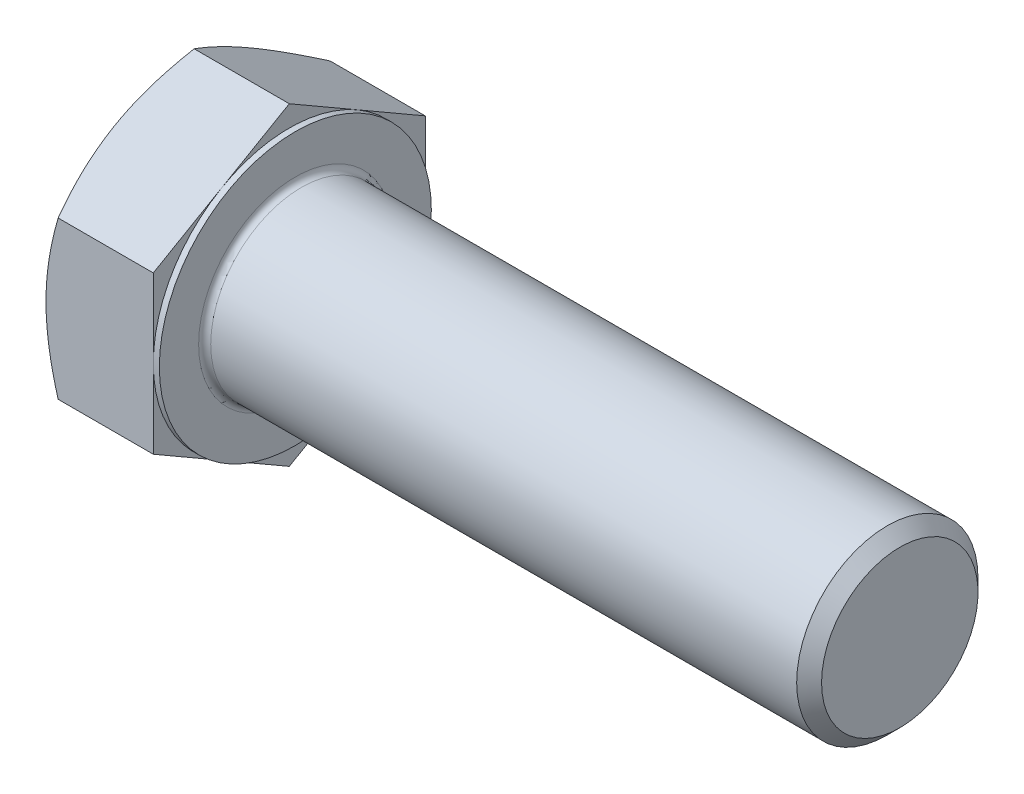
ISO-10303-21;
HEADER;
FILE_DESCRIPTION(('STEP AP214'),'2;1');
FILE_NAME('part.step','',(''),(''),'','','');
FILE_SCHEMA(('AUTOMOTIVE_DESIGN { 1 0 10303 214 1 1 1 1 }'));
ENDSEC;
DATA;
#1=APPLICATION_CONTEXT('core data for automotive mechanical design processes');
#2=APPLICATION_PROTOCOL_DEFINITION('international standard','automotive_design',2000,#1);
#3=PRODUCT_CONTEXT('',#1,'mechanical');
#4=PRODUCT('Part','Part','',(#3));
#5=PRODUCT_RELATED_PRODUCT_CATEGORY('part','',(#4));
#6=PRODUCT_DEFINITION_FORMATION('','',#4);
#7=PRODUCT_DEFINITION_CONTEXT('part definition',#1,'design');
#8=PRODUCT_DEFINITION('design','',#6,#7);
#9=PRODUCT_DEFINITION_SHAPE('','',#8);
#10=(LENGTH_UNIT() NAMED_UNIT(*) SI_UNIT(.MILLI.,.METRE.));
#11=(NAMED_UNIT(*) PLANE_ANGLE_UNIT() SI_UNIT($,.RADIAN.));
#12=(NAMED_UNIT(*) SI_UNIT($,.STERADIAN.) SOLID_ANGLE_UNIT());
#13=UNCERTAINTY_MEASURE_WITH_UNIT(LENGTH_MEASURE(1.E-05),#10,'distance_accuracy_value','');
#14=(GEOMETRIC_REPRESENTATION_CONTEXT(3) GLOBAL_UNCERTAINTY_ASSIGNED_CONTEXT((#13)) GLOBAL_UNIT_ASSIGNED_CONTEXT((#10,
#11,#12)) REPRESENTATION_CONTEXT('',''));
#15=CARTESIAN_POINT('',(0.,0.,0.));
#16=DIRECTION('',(0.,0.,1.));
#17=DIRECTION('',(1.,0.,0.));
#18=AXIS2_PLACEMENT_3D('',#15,#16,#17);
#19=CARTESIAN_POINT('',(15.,-31.1769145362398,-18.));
#20=DIRECTION('',(-1.,0.,0.));
#21=DIRECTION('',(0.,0.,1.));
#22=AXIS2_PLACEMENT_3D('',#19,#20,#21);
#23=PLANE('',#22);
#24=CARTESIAN_POINT('',(15.,0.,0.));
#25=DIRECTION('',(-1.,0.,0.));
#26=DIRECTION('',(0.,0.,1.));
#27=AXIS2_PLACEMENT_3D('',#24,#25,#26);
#28=CIRCLE('',#27,12.8);
#29=CARTESIAN_POINT('',(15.,0.,12.8));
#30=VERTEX_POINT('',#29);
#31=EDGE_CURVE('E11',#30,#30,#28,.T.);
#32=ORIENTED_EDGE('',*,*,#31,.T.);
#33=EDGE_LOOP('',(#32));
#34=FACE_BOUND('',#33,.T.);
#35=CARTESIAN_POINT('',(15.,0.,0.));
#36=DIRECTION('',(-1.,0.,0.));
#37=DIRECTION('',(0.,0.,1.));
#38=AXIS2_PLACEMENT_3D('',#35,#36,#37);
#39=CIRCLE('',#38,18.);
#40=CARTESIAN_POINT('',(15.,0.,18.));
#41=VERTEX_POINT('',#40);
#42=EDGE_CURVE('E163',#41,#41,#39,.T.);
#43=ORIENTED_EDGE('',*,*,#42,.F.);
#44=EDGE_LOOP('',(#43));
#45=FACE_BOUND('',#44,.T.);
#46=ADVANCED_FACE('F34',(#34,#45),#23,.F.);
#47=CARTESIAN_POINT('',(0.,0.,0.));
#48=DIRECTION('',(-1.,0.,0.));
#49=DIRECTION('',(0.,0.,1.));
#50=AXIS2_PLACEMENT_3D('',#47,#48,#49);
#51=CYLINDRICAL_SURFACE('',#50,12.);
#52=CARTESIAN_POINT('',(15.8,0.,0.));
#53=DIRECTION('',(-1.,0.,0.));
#54=DIRECTION('',(0.,0.,1.));
#55=AXIS2_PLACEMENT_3D('',#52,#53,#54);
#56=CIRCLE('',#55,12.);
#57=CARTESIAN_POINT('',(15.8,0.,12.));
#58=VERTEX_POINT('',#57);
#59=EDGE_CURVE('E42',#58,#58,#56,.F.);
#60=ORIENTED_EDGE('',*,*,#59,.T.);
#61=EDGE_LOOP('',(#60));
#62=FACE_BOUND('',#61,.T.);
#63=CARTESIAN_POINT('',(93.352,0.,0.));
#64=DIRECTION('',(-1.,0.,0.));
#65=DIRECTION('',(0.,0.,1.));
#66=AXIS2_PLACEMENT_3D('',#63,#64,#65);
#67=CIRCLE('',#66,12.);
#68=CARTESIAN_POINT('',(93.352,0.,12.));
#69=VERTEX_POINT('',#68);
#70=EDGE_CURVE('E504',#69,#69,#67,.T.);
#71=ORIENTED_EDGE('',*,*,#70,.T.);
#72=EDGE_LOOP('',(#71));
#73=FACE_BOUND('',#72,.T.);
#74=ADVANCED_FACE('F230',(#62,#73),#51,.T.);
#75=CARTESIAN_POINT('',(95.,0.,0.));
#76=DIRECTION('',(-1.,0.,0.));
#77=DIRECTION('',(0.,0.,1.));
#78=AXIS2_PLACEMENT_3D('',#75,#76,#77);
#79=PLANE('',#78);
#80=CARTESIAN_POINT('',(95.,0.,0.));
#81=DIRECTION('',(-1.,0.,0.));
#82=DIRECTION('',(0.,0.,1.));
#83=AXIS2_PLACEMENT_3D('',#80,#81,#82);
#84=CIRCLE('',#83,10.352);
#85=CARTESIAN_POINT('',(95.,0.,10.352));
#86=VERTEX_POINT('',#85);
#87=EDGE_CURVE('E502',#86,#86,#84,.T.);
#88=ORIENTED_EDGE('',*,*,#87,.F.);
#89=EDGE_LOOP('',(#88));
#90=FACE_BOUND('',#89,.T.);
#91=ADVANCED_FACE('F283',(#90),#79,.F.);
#92=CARTESIAN_POINT('',(95.,0.,0.));
#93=DIRECTION('',(-1.,0.,0.));
#94=DIRECTION('',(0.,0.,1.));
#95=AXIS2_PLACEMENT_3D('',#92,#93,#94);
#96=CONICAL_SURFACE('',#95,10.352,0.785398163397445);
#97=ORIENTED_EDGE('',*,*,#70,.F.);
#98=EDGE_LOOP('',(#97));
#99=FACE_BOUND('',#98,.T.);
#100=ORIENTED_EDGE('',*,*,#87,.T.);
#101=EDGE_LOOP('',(#100));
#102=FACE_BOUND('',#101,.T.);
#103=ADVANCED_FACE('F464',(#99,#102),#96,.T.);
#104=CARTESIAN_POINT('',(14.2,20.7846096908265,0.));
#105=DIRECTION('',(1.,0.,0.));
#106=DIRECTION('',(0.,0.,-1.));
#107=AXIS2_PLACEMENT_3D('',#104,#105,#106);
#108=PLANE('',#107);
#109=DIRECTION('',(0.,1.,0.));
#110=VECTOR('',#109,1.);
#111=CARTESIAN_POINT('',(14.2,-10.3923048454133,-18.));
#112=LINE('',#111,#110);
#113=CARTESIAN_POINT('',(14.2,-10.3923048454133,-18.));
#114=VERTEX_POINT('',#113);
#115=CARTESIAN_POINT('',(14.2,0.,-18.));
#116=VERTEX_POINT('',#115);
#117=EDGE_CURVE('E188',#114,#116,#112,.T.);
#118=ORIENTED_EDGE('',*,*,#117,.T.);
#119=CARTESIAN_POINT('',(14.2,0.,0.));
#120=DIRECTION('',(-1.,0.,0.));
#121=DIRECTION('',(0.,0.,1.));
#122=AXIS2_PLACEMENT_3D('',#119,#120,#121);
#123=CIRCLE('',#122,18.);
#124=CARTESIAN_POINT('',(14.2,-15.5884572681199,-9.));
#125=VERTEX_POINT('',#124);
#126=EDGE_CURVE('E49',#116,#125,#123,.T.);
#127=ORIENTED_EDGE('',*,*,#126,.T.);
#128=DIRECTION('',(0.,0.5,-0.866025403784439));
#129=VECTOR('',#128,1.);
#130=CARTESIAN_POINT('',(14.2,-20.7846096908265,0.));
#131=LINE('',#130,#129);
#132=EDGE_CURVE('E166',#125,#114,#131,.T.);
#133=ORIENTED_EDGE('',*,*,#132,.T.);
#134=EDGE_LOOP('',(#118,#127,#133));
#135=FACE_BOUND('',#134,.T.);
#136=ADVANCED_FACE('F187',(#135),#108,.T.);
#137=CARTESIAN_POINT('',(14.2,10.3923048454133,-18.));
#138=VERTEX_POINT('',#137);
#139=EDGE_CURVE('E195',#116,#138,#112,.T.);
#140=ORIENTED_EDGE('',*,*,#139,.T.);
#141=DIRECTION('',(0.,0.5,0.866025403784439));
#142=VECTOR('',#141,1.);
#143=CARTESIAN_POINT('',(14.2,10.3923048454133,-18.));
#144=LINE('',#143,#142);
#145=CARTESIAN_POINT('',(14.2,15.5884572681199,-9.));
#146=VERTEX_POINT('',#145);
#147=EDGE_CURVE('E199',#138,#146,#144,.T.);
#148=ORIENTED_EDGE('',*,*,#147,.T.);
#149=EDGE_CURVE('E329',#146,#116,#123,.T.);
#150=ORIENTED_EDGE('',*,*,#149,.T.);
#151=EDGE_LOOP('',(#140,#148,#150));
#152=FACE_BOUND('',#151,.T.);
#153=ADVANCED_FACE('F333',(#152),#108,.T.);
#154=CARTESIAN_POINT('',(14.2,20.7846096908265,0.));
#155=VERTEX_POINT('',#154);
#156=EDGE_CURVE('E201',#146,#155,#144,.T.);
#157=ORIENTED_EDGE('',*,*,#156,.T.);
#158=DIRECTION('',(0.,-0.5,0.866025403784439));
#159=VECTOR('',#158,1.);
#160=CARTESIAN_POINT('',(14.2,20.7846096908265,0.));
#161=LINE('',#160,#159);
#162=CARTESIAN_POINT('',(14.2,15.5884572681199,9.));
#163=VERTEX_POINT('',#162);
#164=EDGE_CURVE('E134',#155,#163,#161,.T.);
#165=ORIENTED_EDGE('',*,*,#164,.T.);
#166=EDGE_CURVE('E326',#163,#146,#123,.T.);
#167=ORIENTED_EDGE('',*,*,#166,.T.);
#168=EDGE_LOOP('',(#157,#165,#167));
#169=FACE_BOUND('',#168,.T.);
#170=ADVANCED_FACE('F339',(#169),#108,.T.);
#171=CARTESIAN_POINT('',(14.2,10.3923048454133,18.));
#172=VERTEX_POINT('',#171);
#173=EDGE_CURVE('E124',#163,#172,#161,.T.);
#174=ORIENTED_EDGE('',*,*,#173,.T.);
#175=DIRECTION('',(0.,-1.,0.));
#176=VECTOR('',#175,1.);
#177=CARTESIAN_POINT('',(14.2,10.3923048454133,18.));
#178=LINE('',#177,#176);
#179=CARTESIAN_POINT('',(14.2,0.,18.));
#180=VERTEX_POINT('',#179);
#181=EDGE_CURVE('E127',#172,#180,#178,.T.);
#182=ORIENTED_EDGE('',*,*,#181,.T.);
#183=EDGE_CURVE('E130',#180,#163,#123,.T.);
#184=ORIENTED_EDGE('',*,*,#183,.T.);
#185=EDGE_LOOP('',(#174,#182,#184));
#186=FACE_BOUND('',#185,.T.);
#187=ADVANCED_FACE('F126',(#186),#108,.T.);
#188=CARTESIAN_POINT('',(14.2,-10.3923048454132,18.));
#189=VERTEX_POINT('',#188);
#190=EDGE_CURVE('E142',#180,#189,#178,.T.);
#191=ORIENTED_EDGE('',*,*,#190,.T.);
#192=DIRECTION('',(0.,-0.5,-0.866025403784439));
#193=VECTOR('',#192,1.);
#194=CARTESIAN_POINT('',(14.2,-10.3923048454133,18.));
#195=LINE('',#194,#193);
#196=CARTESIAN_POINT('',(14.2,-15.5884572681199,9.));
#197=VERTEX_POINT('',#196);
#198=EDGE_CURVE('E321',#189,#197,#195,.T.);
#199=ORIENTED_EDGE('',*,*,#198,.T.);
#200=EDGE_CURVE('E327',#197,#180,#123,.T.);
#201=ORIENTED_EDGE('',*,*,#200,.T.);
#202=EDGE_LOOP('',(#191,#199,#201));
#203=FACE_BOUND('',#202,.T.);
#204=ADVANCED_FACE('F435',(#203),#108,.T.);
#205=CARTESIAN_POINT('',(14.2,-20.7846096908265,0.));
#206=VERTEX_POINT('',#205);
#207=EDGE_CURVE('E179',#197,#206,#195,.T.);
#208=ORIENTED_EDGE('',*,*,#207,.T.);
#209=EDGE_CURVE('E167',#206,#125,#131,.T.);
#210=ORIENTED_EDGE('',*,*,#209,.T.);
#211=EDGE_CURVE('E177',#125,#197,#123,.T.);
#212=ORIENTED_EDGE('',*,*,#211,.T.);
#213=EDGE_LOOP('',(#208,#210,#212));
#214=FACE_BOUND('',#213,.T.);
#215=ADVANCED_FACE('F176',(#214),#108,.T.);
#216=CARTESIAN_POINT('',(0.,0.,0.));
#217=DIRECTION('',(-1.,0.,0.));
#218=DIRECTION('',(0.,0.,1.));
#219=AXIS2_PLACEMENT_3D('',#216,#217,#218);
#220=CYLINDRICAL_SURFACE('',#219,18.);
#221=ORIENTED_EDGE('',*,*,#126,.F.);
#222=ORIENTED_EDGE('',*,*,#149,.F.);
#223=ORIENTED_EDGE('',*,*,#166,.F.);
#224=ORIENTED_EDGE('',*,*,#183,.F.);
#225=ORIENTED_EDGE('',*,*,#200,.F.);
#226=ORIENTED_EDGE('',*,*,#211,.F.);
#227=EDGE_LOOP('',(#221,#222,#223,#224,#225,#226));
#228=FACE_BOUND('',#227,.T.);
#229=ORIENTED_EDGE('',*,*,#42,.T.);
#230=EDGE_LOOP('',(#229));
#231=FACE_BOUND('',#230,.T.);
#232=ADVANCED_FACE('F289',(#228,#231),#220,.T.);
#233=CARTESIAN_POINT('',(0.,-31.1769145362398,-18.));
#234=DIRECTION('',(-1.,0.,0.));
#235=DIRECTION('',(0.,0.,1.));
#236=AXIS2_PLACEMENT_3D('',#233,#234,#235);
#237=PLANE('',#236);
#238=CARTESIAN_POINT('',(0.,0.,0.));
#239=DIRECTION('',(-1.,0.,0.));
#240=DIRECTION('',(0.,0.,1.));
#241=AXIS2_PLACEMENT_3D('',#238,#239,#240);
#242=CIRCLE('',#241,18.);
#243=CARTESIAN_POINT('',(0.,-15.5884572681199,9.));
#244=VERTEX_POINT('',#243);
#245=CARTESIAN_POINT('',(0.,0.,18.));
#246=VERTEX_POINT('',#245);
#247=EDGE_CURVE('E158',#244,#246,#242,.T.);
#248=ORIENTED_EDGE('',*,*,#247,.T.);
#249=CARTESIAN_POINT('',(0.,0.,0.));
#250=DIRECTION('',(-1.,0.,0.));
#251=DIRECTION('',(0.,0.,1.));
#252=AXIS2_PLACEMENT_3D('',#249,#250,#251);
#253=CIRCLE('',#252,18.);
#254=CARTESIAN_POINT('',(0.,15.5884572681199,9.));
#255=VERTEX_POINT('',#254);
#256=EDGE_CURVE('E57',#246,#255,#253,.T.);
#257=ORIENTED_EDGE('',*,*,#256,.T.);
#258=CARTESIAN_POINT('',(0.,15.5884572681199,-9.));
#259=VERTEX_POINT('',#258);
#260=EDGE_CURVE('E162',#255,#259,#242,.T.);
#261=ORIENTED_EDGE('',*,*,#260,.T.);
#262=CARTESIAN_POINT('',(0.,0.,-18.));
#263=VERTEX_POINT('',#262);
#264=EDGE_CURVE('E346',#259,#263,#242,.T.);
#265=ORIENTED_EDGE('',*,*,#264,.T.);
#266=CARTESIAN_POINT('',(0.,-15.5884572681199,-9.));
#267=VERTEX_POINT('',#266);
#268=EDGE_CURVE('E316',#263,#267,#242,.T.);
#269=ORIENTED_EDGE('',*,*,#268,.T.);
#270=EDGE_CURVE('E161',#267,#244,#242,.T.);
#271=ORIENTED_EDGE('',*,*,#270,.T.);
#272=EDGE_LOOP('',(#248,#257,#261,#265,#269,#271));
#273=FACE_BOUND('',#272,.T.);
#274=ADVANCED_FACE('F286',(#273),#237,.T.);
#275=CARTESIAN_POINT('',(0.,0.,0.));
#276=DIRECTION('',(1.,0.,0.));
#277=DIRECTION('',(0.,0.,-1.));
#278=AXIS2_PLACEMENT_3D('',#275,#276,#277);
#279=CONICAL_SURFACE('',#278,18.,1.0471975511966);
#280=CARTESIAN_POINT('',(1.60776182180893,20.7847251608804,0.000199999999988514));
#281=CARTESIAN_POINT('',(1.47589336556311,20.5563065795853,-0.395432588195899));
#282=CARTESIAN_POINT('',(1.35000889021178,20.3269970432229,-0.79260835583557));
#283=CARTESIAN_POINT('',(1.11187123611097,19.8665391802308,-1.59014476928248));
#284=CARTESIAN_POINT('',(0.999622540659323,19.6353902753093,-1.99050641672052));
#285=CARTESIAN_POINT('',(0.790265297583961,19.1708069369103,-2.79518836317756));
#286=CARTESIAN_POINT('',(0.693192573141009,18.9373684378805,-3.1995157039398));
#287=CARTESIAN_POINT('',(0.516271743787661,18.4688693838575,-4.01097986880548));
#288=CARTESIAN_POINT('',(0.43642265242074,18.2338089225559,-4.41811653063044));
#289=CARTESIAN_POINT('',(0.297345302854858,17.7680889877957,-5.22476711973285));
#290=CARTESIAN_POINT('',(0.237656723113627,17.537464089243,-5.62422116151643));
#291=CARTESIAN_POINT('',(0.13757237566945,17.0751575359747,-6.4249596004493));
#292=CARTESIAN_POINT('',(0.097176979325138,16.8434758610045,-6.82624403268019));
#293=CARTESIAN_POINT('',(0.0366989588175665,16.3797233284791,-7.62948698115296));
#294=CARTESIAN_POINT('',(0.0165921970388532,16.1476532631882,-8.03144412515264));
#295=CARTESIAN_POINT('',(-0.00287614600258849,15.6832989242254,-8.83572943295138));
#296=CARTESIAN_POINT('',(-0.00223836829112279,15.4510146573942,-9.23805758490179));
#297=CARTESIAN_POINT('',(0.0183335794963827,15.0167538648572,-9.99021934131111));
#298=CARTESIAN_POINT('',(0.0357591844006509,14.8147463980876,-10.3401065372642));
#299=CARTESIAN_POINT('',(0.0859690685012216,14.4112133300948,-11.0390463135619));
#300=CARTESIAN_POINT('',(0.118753127736272,14.209687722012,-11.3880989057876));
#301=CARTESIAN_POINT('',(0.199111057578683,13.8071947240359,-12.0852372279728));
#302=CARTESIAN_POINT('',(0.246698302564827,13.6062280054157,-12.4333217952535));
#303=CARTESIAN_POINT('',(0.355822876567437,13.2052512562621,-13.1278338974413));
#304=CARTESIAN_POINT('',(0.417360146472629,13.0052412216786,-13.4742614393635));
#305=CARTESIAN_POINT('',(0.624462075708556,12.3980849696691,-14.525886915977));
#306=CARTESIAN_POINT('',(0.790677467933137,11.99269701467,-15.228039450812));
#307=CARTESIAN_POINT('',(1.16791817029879,11.1879658503706,-16.6218747138126));
#308=CARTESIAN_POINT('',(1.37885488712769,10.78861233823,-17.3135752870211));
#309=CARTESIAN_POINT('',(1.60776182180894,10.3921893753594,-18.0002));
#310=B_SPLINE_CURVE_WITH_KNOTS('',3,(#280,#281,#282,#283,#284,#285,#286,#287,#288,#289,#290,
#291,#292,#293,#294,#295,#296,#297,#298,#299,#300,#301,#302,#303,#304,#305,#306,#307,#308,#309),
.UNSPECIFIED.,.F.,.F.,(4,2,2,2,2,2,2,2,2,2,2,2,2,2,4),(0.,1.42650335783821,2.85347447244912,
4.28376471280637,5.71397301377358,7.10888071673008,8.50381526803681,9.8970882864255,
11.2903182514067,12.5031974791544,13.7160593367767,14.9300201888636,16.1439758970578,
18.6253607678546,21.1018751738864),.UNSPECIFIED.);
#311=CARTESIAN_POINT('',(1.60769515458671,10.3923048454133,-18.));
#312=VERTEX_POINT('',#311);
#313=EDGE_CURVE('E251',#259,#312,#310,.T.);
#314=ORIENTED_EDGE('',*,*,#313,.T.);
#315=CARTESIAN_POINT('',(8.61348069558259,-27.5619239548148,-18.));
#316=CARTESIAN_POINT('',(8.42247770487625,-27.1667877315058,-18.));
#317=CARTESIAN_POINT('',(8.23246323890999,-26.7711739061182,-18.));
#318=CARTESIAN_POINT('',(7.85463825903298,-25.978890150394,-18.));
#319=CARTESIAN_POINT('',(7.66682776933909,-25.5822202085116,-18.));
#320=CARTESIAN_POINT('',(7.10698821398384,-24.3903587108182,-18.));
#321=CARTESIAN_POINT('',(6.73861331929509,-23.5934439060383,-18.));
#322=CARTESIAN_POINT('',(6.01187832115791,-21.9895471419339,-18.));
#323=CARTESIAN_POINT('',(5.65358759191455,-21.1825336697993,-18.));
#324=CARTESIAN_POINT('',(4.95238944922599,-19.5618746110391,-18.));
#325=CARTESIAN_POINT('',(4.60948123455548,-18.7482293724554,-18.));
#326=CARTESIAN_POINT('',(3.93907746984919,-17.1029123101683,-18.));
#327=CARTESIAN_POINT('',(3.611822824219,-16.2711418104043,-18.));
#328=CARTESIAN_POINT('',(2.98294292414897,-14.597784286177,-18.));
#329=CARTESIAN_POINT('',(2.68132051830493,-13.7561961824397,-18.));
#330=CARTESIAN_POINT('',(2.11181367719722,-12.0636207961924,-18.));
#331=CARTESIAN_POINT('',(1.84385751159756,-11.2126578484076,-18.));
#332=CARTESIAN_POINT('',(1.35037221005327,-9.49855213955008,-18.));
#333=CARTESIAN_POINT('',(1.12482967084635,-8.6354133192177,-18.));
#334=CARTESIAN_POINT('',(0.826582549265735,-7.33140916170395,-18.));
#335=CARTESIAN_POINT('',(0.733829359654179,-6.89509921035708,-18.));
#336=CARTESIAN_POINT('',(0.563143175648555,-6.01957542081141,-18.));
#337=CARTESIAN_POINT('',(0.485209848425089,-5.5803616480569,-18.));
#338=CARTESIAN_POINT('',(0.345545035996542,-4.6993249922613,-18.));
#339=CARTESIAN_POINT('',(0.283814545859593,-4.25750195067963,-18.));
#340=CARTESIAN_POINT('',(0.177795282016646,-3.37175302675203,-18.));
#341=CARTESIAN_POINT('',(0.133506529040348,-2.92782714190747,-18.));
#342=CARTESIAN_POINT('',(0.0635630456590339,-2.04133804004202,-18.));
#343=CARTESIAN_POINT('',(0.0377917228553154,-1.598784082632,-18.));
#344=CARTESIAN_POINT('',(0.00501858439047123,-0.71298392663332,-18.));
#345=CARTESIAN_POINT('',(-0.00198351486751646,-0.269737738605294,-18.));
#346=CARTESIAN_POINT('',(0.00294785959398501,0.616528728146651,-18.));
#347=CARTESIAN_POINT('',(0.0148760951972279,1.05954903544431,-18.));
#348=CARTESIAN_POINT('',(0.0573715406355315,1.9446967341162,-18.));
#349=CARTESIAN_POINT('',(0.0879395709693337,2.38682408532411,-18.));
#350=CARTESIAN_POINT('',(0.183949699310033,3.45808110656982,-18.));
#351=CARTESIAN_POINT('',(0.258712176286864,4.08639173381695,-18.));
#352=CARTESIAN_POINT('',(0.441718453052997,5.33809089438755,-18.));
#353=CARTESIAN_POINT('',(0.549967219980592,5.96147868341138,-18.));
#354=CARTESIAN_POINT('',(0.919513530705796,7.82534534353266,-18.));
#355=CARTESIAN_POINT('',(1.22536507351815,9.05709271194062,-18.));
#356=CARTESIAN_POINT('',(1.75275444511229,10.8995809919375,-18.));
#357=CARTESIAN_POINT('',(1.94256699353448,11.5199484618673,-18.));
#358=CARTESIAN_POINT('',(2.34111719438654,12.7546900315391,-18.));
#359=CARTESIAN_POINT('',(2.54985655520624,13.3690635846978,-18.));
#360=CARTESIAN_POINT('',(2.98181266937965,14.5887549052585,-18.));
#361=CARTESIAN_POINT('',(3.20494114020181,15.1941042030674,-18.));
#362=CARTESIAN_POINT('',(3.54929436882718,16.0983156250989,-18.));
#363=CARTESIAN_POINT('',(3.66566915677894,16.3990354213605,-18.));
#364=CARTESIAN_POINT('',(3.90137756017451,16.9993068009234,-18.));
#365=CARTESIAN_POINT('',(4.0207111169603,17.298858407248,-18.));
#366=CARTESIAN_POINT('',(4.14139052943799,17.5978664544007,-18.));
#367=B_SPLINE_CURVE_WITH_KNOTS('',3,(#315,#316,#317,#318,#319,#320,#321,#322,#323,#324,#325,
#326,#327,#328,#329,#330,#331,#332,#333,#334,#335,#336,#337,#338,#339,#340,#341,#342,#343,#344,
#345,#346,#347,#348,#349,#350,#351,#352,#353,#354,#355,#356,#357,#358,#359,#360,#361,#362,#363,
#364,#365,#366),.UNSPECIFIED.,.F.,.F.,(4,2,2,2,2,2,2,2,2,2,2,2,2,2,2,2,2,2,2,2,2,2,2,2,2,4),(0.,
1.3166344390565,2.6332833315075,5.26700924472548,7.91580691121446,10.5644664498451,
13.2456434009398,15.9271179315146,18.6027786855858,21.2775924696093,22.6155612790714,
23.9535000364353,25.2915209416894,26.6295434371915,27.9590656257616,29.2885677255708,
30.6177020097832,31.9468948049265,33.8440459909246,35.7414787230295,39.5436531019888,
41.4897689730644,43.4360606814942,45.3713764468858,46.3387197810933,47.3060439528869),.UNSPECIFIED.);
#368=EDGE_CURVE('E308',#312,#263,#367,.F.);
#369=ORIENTED_EDGE('',*,*,#368,.T.);
#370=ORIENTED_EDGE('',*,*,#264,.F.);
#371=EDGE_LOOP('',(#314,#369,#370));
#372=FACE_BOUND('',#371,.T.);
#373=ADVANCED_FACE('F288',(#372),#279,.T.);
#374=CARTESIAN_POINT('',(1.60776182180893,10.3921893753594,18.0002));
#375=CARTESIAN_POINT('',(1.47589336556311,10.6206079566545,17.6045674118041));
#376=CARTESIAN_POINT('',(1.35000889021178,10.8499174930169,17.2073916441644));
#377=CARTESIAN_POINT('',(1.11187123611097,11.310375356009,16.4098552307175));
#378=CARTESIAN_POINT('',(0.999622540659318,11.5415242609305,16.0094935832795));
#379=CARTESIAN_POINT('',(0.790265297583954,12.0061075993295,15.2048116368224));
#380=CARTESIAN_POINT('',(0.693192573141003,12.2395460983593,14.8004842960602));
#381=CARTESIAN_POINT('',(0.516271743787655,12.7080451523823,13.9890201311945));
#382=CARTESIAN_POINT('',(0.436422652420735,12.9431056136839,13.5818834693696));
#383=CARTESIAN_POINT('',(0.297345302854855,13.4088255484441,12.7752328802672));
#384=CARTESIAN_POINT('',(0.237656723113623,13.6394504469968,12.3757788384836));
#385=CARTESIAN_POINT('',(0.137572375669445,14.1017570002651,11.5750403995507));
#386=CARTESIAN_POINT('',(0.0971769793251319,14.3334386752352,11.1737559673198));
#387=CARTESIAN_POINT('',(0.0366989588175608,14.7971912077607,10.370513018847));
#388=CARTESIAN_POINT('',(0.0165921970388493,15.0292612730516,9.96855587484737));
#389=CARTESIAN_POINT('',(-0.00287614600259162,15.4936156120144,9.16427056704862));
#390=CARTESIAN_POINT('',(-0.0022383682911269,15.7258998788456,8.76194241509821));
#391=CARTESIAN_POINT('',(0.0183335794963778,16.1601606713826,8.00978065868889));
#392=CARTESIAN_POINT('',(0.0357591844006459,16.3621681381522,7.65989346273577));
#393=CARTESIAN_POINT('',(0.0859690685012156,16.765701206145,6.96095368643808));
#394=CARTESIAN_POINT('',(0.118753127736265,16.9672268142278,6.61190109421241));
#395=CARTESIAN_POINT('',(0.199111057578677,17.3697198122039,5.91476277202715));
#396=CARTESIAN_POINT('',(0.246698302564824,17.5706865308241,5.56667820474646));
#397=CARTESIAN_POINT('',(0.355822876567435,17.9716632799777,4.87216610255866));
#398=CARTESIAN_POINT('',(0.417360146472626,18.1716733145612,4.5257385606365));
#399=CARTESIAN_POINT('',(0.62446207570855,18.7788295665707,3.47411308402298));
#400=CARTESIAN_POINT('',(0.790677467933132,19.1842175215698,2.771960549188));
#401=CARTESIAN_POINT('',(1.16791817029878,19.9889486858692,1.37812528618741));
#402=CARTESIAN_POINT('',(1.37885488712768,20.3883021980098,0.686424712978874));
#403=CARTESIAN_POINT('',(1.60776182180893,20.7847251608804,-0.000200000000011657));
#404=B_SPLINE_CURVE_WITH_KNOTS('',3,(#374,#375,#376,#377,#378,#379,#380,#381,#382,#383,#384,
#385,#386,#387,#388,#389,#390,#391,#392,#393,#394,#395,#396,#397,#398,#399,#400,#401,#402,#403),
.UNSPECIFIED.,.F.,.F.,(4,2,2,2,2,2,2,2,2,2,2,2,2,2,4),(0.,1.42650335783821,2.85347447244912,
4.28376471280637,5.71397301377358,7.10888071673007,8.5038152680368,9.89708828642549,
11.2903182514067,12.5031974791544,13.7160593367767,14.9300201888636,16.1439758970578,
18.6253607678546,21.1018751738864),.UNSPECIFIED.);
#405=CARTESIAN_POINT('',(1.60769515458671,20.7846096908265,0.));
#406=VERTEX_POINT('',#405);
#407=EDGE_CURVE('E259',#255,#406,#404,.T.);
#408=ORIENTED_EDGE('',*,*,#407,.T.);
#409=EDGE_CURVE('E258',#406,#259,#310,.T.);
#410=ORIENTED_EDGE('',*,*,#409,.T.);
#411=ORIENTED_EDGE('',*,*,#260,.F.);
#412=EDGE_LOOP('',(#408,#410,#411));
#413=FACE_BOUND('',#412,.T.);
#414=ADVANCED_FACE('F227',(#413),#279,.T.);
#415=CARTESIAN_POINT('',(1.60769515458671,10.3923048454133,18.));
#416=VERTEX_POINT('',#415);
#417=EDGE_CURVE('E147',#416,#255,#404,.T.);
#418=ORIENTED_EDGE('',*,*,#417,.T.);
#419=ORIENTED_EDGE('',*,*,#256,.F.);
#420=CARTESIAN_POINT('',(8.61348069558256,-27.5619239548148,18.));
#421=CARTESIAN_POINT('',(8.42247770487623,-27.1667877315058,18.));
#422=CARTESIAN_POINT('',(8.23246323890996,-26.7711739061182,18.));
#423=CARTESIAN_POINT('',(7.85463825903296,-25.9788901503939,18.));
#424=CARTESIAN_POINT('',(7.66682776933907,-25.5822202085115,18.));
#425=CARTESIAN_POINT('',(7.10698821398383,-24.3903587108182,18.));
#426=CARTESIAN_POINT('',(6.73861331929507,-23.5934439060383,18.));
#427=CARTESIAN_POINT('',(6.01187832115789,-21.9895471419339,18.));
#428=CARTESIAN_POINT('',(5.65358759191454,-21.1825336697993,18.));
#429=CARTESIAN_POINT('',(4.95238944922597,-19.5618746110391,18.));
#430=CARTESIAN_POINT('',(4.60948123455547,-18.7482293724554,18.));
#431=CARTESIAN_POINT('',(3.93907746984918,-17.1029123101683,18.));
#432=CARTESIAN_POINT('',(3.61182282421899,-16.2711418104042,18.));
#433=CARTESIAN_POINT('',(2.98294292414896,-14.597784286177,18.));
#434=CARTESIAN_POINT('',(2.68132051830492,-13.7561961824397,18.));
#435=CARTESIAN_POINT('',(2.11181367719721,-12.0636207961924,18.));
#436=CARTESIAN_POINT('',(1.84385751159755,-11.2126578484076,18.));
#437=CARTESIAN_POINT('',(1.35037221005326,-9.49855213955007,18.));
#438=CARTESIAN_POINT('',(1.12482967084634,-8.63541331921768,18.));
#439=CARTESIAN_POINT('',(0.826582549265725,-7.33140916170394,18.));
#440=CARTESIAN_POINT('',(0.733829359654169,-6.89509921035707,18.));
#441=CARTESIAN_POINT('',(0.563143175648545,-6.0195754208114,18.));
#442=CARTESIAN_POINT('',(0.485209848425079,-5.58036164805688,18.));
#443=CARTESIAN_POINT('',(0.345545035996532,-4.69932499226129,18.));
#444=CARTESIAN_POINT('',(0.283814545859583,-4.25750195067962,18.));
#445=CARTESIAN_POINT('',(0.177795282016635,-3.37175302675202,18.));
#446=CARTESIAN_POINT('',(0.133506529040337,-2.92782714190746,18.));
#447=CARTESIAN_POINT('',(0.0635630456590234,-2.04133804004202,18.));
#448=CARTESIAN_POINT('',(0.0377917228553061,-1.59878408263199,18.));
#449=CARTESIAN_POINT('',(0.0050185843904628,-0.712983926633312,18.));
#450=CARTESIAN_POINT('',(-0.00198351486752519,-0.269737738605287,18.));
#451=CARTESIAN_POINT('',(0.00294785959397568,0.616528728146657,18.));
#452=CARTESIAN_POINT('',(0.0148760951972183,1.05954903544431,18.));
#453=CARTESIAN_POINT('',(0.0573715406355229,1.94469673411621,18.));
#454=CARTESIAN_POINT('',(0.0879395709693262,2.38682408532411,18.));
#455=CARTESIAN_POINT('',(0.183949699310026,3.45808110656982,18.));
#456=CARTESIAN_POINT('',(0.258712176286855,4.08639173381695,18.));
#457=CARTESIAN_POINT('',(0.441718453052986,5.33809089438755,18.));
#458=CARTESIAN_POINT('',(0.549967219980582,5.96147868341138,18.));
#459=CARTESIAN_POINT('',(0.919513530705788,7.82534534353266,18.));
#460=CARTESIAN_POINT('',(1.22536507351814,9.05709271194062,18.));
#461=CARTESIAN_POINT('',(1.75275444511228,10.8995809919375,18.));
#462=CARTESIAN_POINT('',(1.94256699353447,11.5199484618673,18.));
#463=CARTESIAN_POINT('',(2.34111719438653,12.7546900315391,18.));
#464=CARTESIAN_POINT('',(2.54985655520623,13.3690635846978,18.));
#465=CARTESIAN_POINT('',(2.98181266937964,14.5887549052585,18.));
#466=CARTESIAN_POINT('',(3.2049411402018,15.1941042030674,18.));
#467=CARTESIAN_POINT('',(3.54929436882717,16.0983156250989,18.));
#468=CARTESIAN_POINT('',(3.66566915677892,16.3990354213605,18.));
#469=CARTESIAN_POINT('',(3.9013775601745,16.9993068009233,18.));
#470=CARTESIAN_POINT('',(4.02071111696029,17.298858407248,18.));
#471=CARTESIAN_POINT('',(4.14139052943798,17.5978664544007,18.));
#472=B_SPLINE_CURVE_WITH_KNOTS('',3,(#420,#421,#422,#423,#424,#425,#426,#427,#428,#429,#430,
#431,#432,#433,#434,#435,#436,#437,#438,#439,#440,#441,#442,#443,#444,#445,#446,#447,#448,#449,
#450,#451,#452,#453,#454,#455,#456,#457,#458,#459,#460,#461,#462,#463,#464,#465,#466,#467,#468,
#469,#470,#471),.UNSPECIFIED.,.F.,.F.,(4,2,2,2,2,2,2,2,2,2,2,2,2,2,2,2,2,2,2,2,2,2,2,2,2,4),(0.,
1.31663443905649,2.6332833315075,5.26700924472548,7.91580691121444,10.5644664498451,
13.2456434009398,15.9271179315146,18.6027786855858,21.2775924696093,22.6155612790714,
23.9535000364353,25.2915209416894,26.6295434371915,27.9590656257616,29.2885677255707,
30.6177020097832,31.9468948049265,33.8440459909246,35.7414787230294,39.5436531019888,
41.4897689730643,43.4360606814942,45.3713764468858,46.3387197810932,47.3060439528868),.UNSPECIFIED.);
#473=EDGE_CURVE('E305',#246,#416,#472,.T.);
#474=ORIENTED_EDGE('',*,*,#473,.T.);
#475=EDGE_LOOP('',(#418,#419,#474));
#476=FACE_BOUND('',#475,.T.);
#477=ADVANCED_FACE('F221',(#476),#279,.T.);
#478=CARTESIAN_POINT('',(1.60769515458671,-10.3923048454132,18.));
#479=VERTEX_POINT('',#478);
#480=EDGE_CURVE('E244',#479,#246,#472,.T.);
#481=ORIENTED_EDGE('',*,*,#480,.T.);
#482=ORIENTED_EDGE('',*,*,#247,.F.);
#483=CARTESIAN_POINT('',(1.60776182180893,-20.7847251608804,-0.000200000000020936));
#484=CARTESIAN_POINT('',(1.47589336556311,-20.5563065795853,0.395432588195868));
#485=CARTESIAN_POINT('',(1.35000889021178,-20.3269970432229,0.79260835583554));
#486=CARTESIAN_POINT('',(1.11187123611097,-19.8665391802308,1.59014476928245));
#487=CARTESIAN_POINT('',(0.999622540659318,-19.6353902753093,1.99050641672049));
#488=CARTESIAN_POINT('',(0.790265297583955,-19.1708069369103,2.79518836317752));
#489=CARTESIAN_POINT('',(0.693192573141003,-18.9373684378805,3.19951570393976));
#490=CARTESIAN_POINT('',(0.516271743787653,-18.4688693838575,4.01097986880544));
#491=CARTESIAN_POINT('',(0.436422652420731,-18.2338089225559,4.4181165306304));
#492=CARTESIAN_POINT('',(0.297345302854849,-17.7680889877957,5.22476711973281));
#493=CARTESIAN_POINT('',(0.237656723113618,-17.537464089243,5.6242211615164));
#494=CARTESIAN_POINT('',(0.13757237566944,-17.0751575359747,6.42495960044926));
#495=CARTESIAN_POINT('',(0.0971769793251269,-16.8434758610045,6.82624403268015));
#496=CARTESIAN_POINT('',(0.0366989588175547,-16.3797233284791,7.62948698115292));
#497=CARTESIAN_POINT('',(0.0165921970388419,-16.1476532631882,8.03144412515259));
#498=CARTESIAN_POINT('',(-0.00287614600259923,-15.6832989242254,8.83572943295134));
#499=CARTESIAN_POINT('',(-0.00223836829113357,-15.4510146573942,9.23805758490175));
#500=CARTESIAN_POINT('',(0.0183335794963696,-15.0167538648572,9.99021934131108));
#501=CARTESIAN_POINT('',(0.0357591844006358,-14.8147463980876,10.3401065372642));
#502=CARTESIAN_POINT('',(0.0859690685012052,-14.4112133300948,11.0390463135619));
#503=CARTESIAN_POINT('',(0.118753127736257,-14.209687722012,11.3880989057876));
#504=CARTESIAN_POINT('',(0.199111057578669,-13.8071947240359,12.0852372279728));
#505=CARTESIAN_POINT('',(0.246698302564814,-13.6062280054156,12.4333217952535));
#506=CARTESIAN_POINT('',(0.355822876567424,-13.2052512562621,13.1278338974413));
#507=CARTESIAN_POINT('',(0.417360146472616,-13.0052412216786,13.4742614393635));
#508=CARTESIAN_POINT('',(0.624462075708541,-12.3980849696691,14.525886915977));
#509=CARTESIAN_POINT('',(0.790677467933124,-11.99269701467,15.228039450812));
#510=CARTESIAN_POINT('',(1.16791817029877,-11.1879658503706,16.6218747138126));
#511=CARTESIAN_POINT('',(1.37885488712768,-10.78861233823,17.3135752870211));
#512=CARTESIAN_POINT('',(1.60776182180893,-10.3921893753594,18.0002));
#513=B_SPLINE_CURVE_WITH_KNOTS('',3,(#483,#484,#485,#486,#487,#488,#489,#490,#491,#492,#493,
#494,#495,#496,#497,#498,#499,#500,#501,#502,#503,#504,#505,#506,#507,#508,#509,#510,#511,#512),
.UNSPECIFIED.,.F.,.F.,(4,2,2,2,2,2,2,2,2,2,2,2,2,2,4),(0.,1.42650335783821,2.85347447244912,
4.28376471280637,5.71397301377358,7.10888071673007,8.50381526803679,9.89708828642549,
11.2903182514067,12.5031974791544,13.7160593367767,14.9300201888636,16.1439758970578,
18.6253607678546,21.1018751738864),.UNSPECIFIED.);
#514=EDGE_CURVE('E307',#244,#479,#513,.T.);
#515=ORIENTED_EDGE('',*,*,#514,.T.);
#516=EDGE_LOOP('',(#481,#482,#515));
#517=FACE_BOUND('',#516,.T.);
#518=ADVANCED_FACE('F226',(#517),#279,.T.);
#519=CARTESIAN_POINT('',(1.60769515458671,-10.3923048454133,-18.));
#520=VERTEX_POINT('',#519);
#521=EDGE_CURVE('E238',#263,#520,#367,.F.);
#522=ORIENTED_EDGE('',*,*,#521,.T.);
#523=CARTESIAN_POINT('',(1.60776182180894,-10.3921893753594,-18.0002));
#524=CARTESIAN_POINT('',(1.47589336556312,-10.6206079566545,-17.6045674118041));
#525=CARTESIAN_POINT('',(1.35000889021178,-10.8499174930169,-17.2073916441644));
#526=CARTESIAN_POINT('',(1.11187123611097,-11.310375356009,-16.4098552307175));
#527=CARTESIAN_POINT('',(0.999622540659326,-11.5415242609305,-16.0094935832795));
#528=CARTESIAN_POINT('',(0.790265297583963,-12.0061075993295,-15.2048116368225));
#529=CARTESIAN_POINT('',(0.69319257314101,-12.2395460983593,-14.8004842960602));
#530=CARTESIAN_POINT('',(0.516271743787661,-12.7080451523823,-13.9890201311945));
#531=CARTESIAN_POINT('',(0.436422652420741,-12.9431056136839,-13.5818834693696));
#532=CARTESIAN_POINT('',(0.297345302854859,-13.4088255484441,-12.7752328802672));
#533=CARTESIAN_POINT('',(0.237656723113628,-13.6394504469968,-12.3757788384836));
#534=CARTESIAN_POINT('',(0.13757237566945,-14.1017570002651,-11.5750403995507));
#535=CARTESIAN_POINT('',(0.0971769793251384,-14.3334386752352,-11.1737559673198));
#536=CARTESIAN_POINT('',(0.0366989588175674,-14.7971912077607,-10.370513018847));
#537=CARTESIAN_POINT('',(0.0165921970388549,-15.0292612730516,-9.96855587484738));
#538=CARTESIAN_POINT('',(-0.00287614600258619,-15.4936156120144,-9.16427056704863));
#539=CARTESIAN_POINT('',(-0.00223836829112061,-15.7258998788456,-8.76194241509822));
#540=CARTESIAN_POINT('',(0.0183335794963835,-16.1601606713826,-8.00978065868889));
#541=CARTESIAN_POINT('',(0.0357591844006506,-16.3621681381522,-7.65989346273578));
#542=CARTESIAN_POINT('',(0.0859690685012204,-16.765701206145,-6.96095368643809));
#543=CARTESIAN_POINT('',(0.118753127736272,-16.9672268142278,-6.61190109421243));
#544=CARTESIAN_POINT('',(0.199111057578683,-17.3697198122039,-5.91476277202717));
#545=CARTESIAN_POINT('',(0.246698302564828,-17.5706865308241,-5.56667820474647));
#546=CARTESIAN_POINT('',(0.355822876567437,-17.9716632799777,-4.87216610255868));
#547=CARTESIAN_POINT('',(0.417360146472627,-18.1716733145612,-4.52573856063652));
#548=CARTESIAN_POINT('',(0.624462075708551,-18.7788295665707,-3.474113084023));
#549=CARTESIAN_POINT('',(0.790677467933132,-19.1842175215698,-2.77196054918803));
#550=CARTESIAN_POINT('',(1.16791817029878,-19.9889486858692,-1.37812528618744));
#551=CARTESIAN_POINT('',(1.37885488712768,-20.3883021980097,-0.686424712978902));
#552=CARTESIAN_POINT('',(1.60776182180893,-20.7847251608804,0.000199999999980759));
#553=B_SPLINE_CURVE_WITH_KNOTS('',3,(#523,#524,#525,#526,#527,#528,#529,#530,#531,#532,#533,
#534,#535,#536,#537,#538,#539,#540,#541,#542,#543,#544,#545,#546,#547,#548,#549,#550,#551,#552),
.UNSPECIFIED.,.F.,.F.,(4,2,2,2,2,2,2,2,2,2,2,2,2,2,4),(0.,1.42650335783821,2.85347447244912,
4.28376471280637,5.71397301377358,7.10888071673008,8.50381526803681,9.89708828642549,
11.2903182514067,12.5031974791544,13.7160593367767,14.9300201888636,16.1439758970578,
18.6253607678546,21.1018751738864),.UNSPECIFIED.);
#554=EDGE_CURVE('E211',#520,#267,#553,.T.);
#555=ORIENTED_EDGE('',*,*,#554,.T.);
#556=ORIENTED_EDGE('',*,*,#268,.F.);
#557=EDGE_LOOP('',(#522,#555,#556));
#558=FACE_BOUND('',#557,.T.);
#559=ADVANCED_FACE('F315',(#558),#279,.T.);
#560=CARTESIAN_POINT('',(1.60769515458671,-20.7846096908265,0.));
#561=VERTEX_POINT('',#560);
#562=EDGE_CURVE('E212',#561,#244,#513,.T.);
#563=ORIENTED_EDGE('',*,*,#562,.T.);
#564=ORIENTED_EDGE('',*,*,#270,.F.);
#565=EDGE_CURVE('E197',#267,#561,#553,.T.);
#566=ORIENTED_EDGE('',*,*,#565,.T.);
#567=EDGE_LOOP('',(#563,#564,#566));
#568=FACE_BOUND('',#567,.T.);
#569=ADVANCED_FACE('F228',(#568),#279,.T.);
#570=CARTESIAN_POINT('',(15.,-20.7846096908265,0.));
#571=DIRECTION('',(0.,0.866025403784439,0.5));
#572=DIRECTION('',(0.,-0.5,0.866025403784439));
#573=AXIS2_PLACEMENT_3D('',#570,#571,#572);
#574=PLANE('',#573);
#575=ORIENTED_EDGE('',*,*,#209,.F.);
#576=DIRECTION('',(-1.,0.,0.));
#577=VECTOR('',#576,1.);
#578=CARTESIAN_POINT('',(15.,-20.7846096908265,0.));
#579=LINE('',#578,#577);
#580=EDGE_CURVE('E153',#206,#561,#579,.T.);
#581=ORIENTED_EDGE('',*,*,#580,.T.);
#582=ORIENTED_EDGE('',*,*,#565,.F.);
#583=ORIENTED_EDGE('',*,*,#554,.F.);
#584=DIRECTION('',(-1.,0.,0.));
#585=VECTOR('',#584,1.);
#586=CARTESIAN_POINT('',(15.,-10.3923048454133,-18.));
#587=LINE('',#586,#585);
#588=EDGE_CURVE('E185',#114,#520,#587,.T.);
#589=ORIENTED_EDGE('',*,*,#588,.F.);
#590=ORIENTED_EDGE('',*,*,#132,.F.);
#591=EDGE_LOOP('',(#575,#581,#582,#583,#589,#590));
#592=FACE_BOUND('',#591,.T.);
#593=ADVANCED_FACE('F183',(#592),#574,.F.);
#594=CARTESIAN_POINT('',(15.,-10.3923048454133,18.));
#595=DIRECTION('',(0.,0.866025403784439,-0.5));
#596=DIRECTION('',(0.,0.5,0.866025403784439));
#597=AXIS2_PLACEMENT_3D('',#594,#595,#596);
#598=PLANE('',#597);
#599=ORIENTED_EDGE('',*,*,#198,.F.);
#600=DIRECTION('',(-1.,0.,0.));
#601=VECTOR('',#600,1.);
#602=CARTESIAN_POINT('',(15.,-10.3923048454133,18.));
#603=LINE('',#602,#601);
#604=EDGE_CURVE('E149',#189,#479,#603,.T.);
#605=ORIENTED_EDGE('',*,*,#604,.T.);
#606=ORIENTED_EDGE('',*,*,#514,.F.);
#607=ORIENTED_EDGE('',*,*,#562,.F.);
#608=ORIENTED_EDGE('',*,*,#580,.F.);
#609=ORIENTED_EDGE('',*,*,#207,.F.);
#610=EDGE_LOOP('',(#599,#605,#606,#607,#608,#609));
#611=FACE_BOUND('',#610,.T.);
#612=ADVANCED_FACE('F320',(#611),#598,.F.);
#613=CARTESIAN_POINT('',(15.,10.3923048454133,18.));
#614=DIRECTION('',(0.,0.,-1.));
#615=DIRECTION('',(-1.,0.,0.));
#616=AXIS2_PLACEMENT_3D('',#613,#614,#615);
#617=PLANE('',#616);
#618=ORIENTED_EDGE('',*,*,#181,.F.);
#619=DIRECTION('',(-1.,0.,0.));
#620=VECTOR('',#619,1.);
#621=CARTESIAN_POINT('',(15.,10.3923048454133,18.));
#622=LINE('',#621,#620);
#623=EDGE_CURVE('E140',#172,#416,#622,.T.);
#624=ORIENTED_EDGE('',*,*,#623,.T.);
#625=ORIENTED_EDGE('',*,*,#473,.F.);
#626=ORIENTED_EDGE('',*,*,#480,.F.);
#627=ORIENTED_EDGE('',*,*,#604,.F.);
#628=ORIENTED_EDGE('',*,*,#190,.F.);
#629=EDGE_LOOP('',(#618,#624,#625,#626,#627,#628));
#630=FACE_BOUND('',#629,.T.);
#631=ADVANCED_FACE('F138',(#630),#617,.F.);
#632=CARTESIAN_POINT('',(15.,20.7846096908265,0.));
#633=DIRECTION('',(0.,-0.866025403784439,-0.5));
#634=DIRECTION('',(0.,0.5,-0.866025403784439));
#635=AXIS2_PLACEMENT_3D('',#632,#633,#634);
#636=PLANE('',#635);
#637=ORIENTED_EDGE('',*,*,#164,.F.);
#638=DIRECTION('',(-1.,0.,0.));
#639=VECTOR('',#638,1.);
#640=CARTESIAN_POINT('',(15.,20.7846096908265,0.));
#641=LINE('',#640,#639);
#642=EDGE_CURVE('E148',#155,#406,#641,.T.);
#643=ORIENTED_EDGE('',*,*,#642,.T.);
#644=ORIENTED_EDGE('',*,*,#407,.F.);
#645=ORIENTED_EDGE('',*,*,#417,.F.);
#646=ORIENTED_EDGE('',*,*,#623,.F.);
#647=ORIENTED_EDGE('',*,*,#173,.F.);
#648=EDGE_LOOP('',(#637,#643,#644,#645,#646,#647));
#649=FACE_BOUND('',#648,.T.);
#650=ADVANCED_FACE('F145',(#649),#636,.F.);
#651=CARTESIAN_POINT('',(15.,10.3923048454133,-18.));
#652=DIRECTION('',(0.,-0.866025403784439,0.5));
#653=DIRECTION('',(0.,-0.5,-0.866025403784439));
#654=AXIS2_PLACEMENT_3D('',#651,#652,#653);
#655=PLANE('',#654);
#656=ORIENTED_EDGE('',*,*,#147,.F.);
#657=DIRECTION('',(-1.,0.,0.));
#658=VECTOR('',#657,1.);
#659=CARTESIAN_POINT('',(15.,10.3923048454133,-18.));
#660=LINE('',#659,#658);
#661=EDGE_CURVE('E151',#138,#312,#660,.T.);
#662=ORIENTED_EDGE('',*,*,#661,.T.);
#663=ORIENTED_EDGE('',*,*,#313,.F.);
#664=ORIENTED_EDGE('',*,*,#409,.F.);
#665=ORIENTED_EDGE('',*,*,#642,.F.);
#666=ORIENTED_EDGE('',*,*,#156,.F.);
#667=EDGE_LOOP('',(#656,#662,#663,#664,#665,#666));
#668=FACE_BOUND('',#667,.T.);
#669=ADVANCED_FACE('F266',(#668),#655,.F.);
#670=CARTESIAN_POINT('',(15.,-10.3923048454133,-18.));
#671=DIRECTION('',(0.,0.,1.));
#672=DIRECTION('',(0.,-1.,0.));
#673=AXIS2_PLACEMENT_3D('',#670,#671,#672);
#674=PLANE('',#673);
#675=ORIENTED_EDGE('',*,*,#117,.F.);
#676=ORIENTED_EDGE('',*,*,#588,.T.);
#677=ORIENTED_EDGE('',*,*,#521,.F.);
#678=ORIENTED_EDGE('',*,*,#368,.F.);
#679=ORIENTED_EDGE('',*,*,#661,.F.);
#680=ORIENTED_EDGE('',*,*,#139,.F.);
#681=EDGE_LOOP('',(#675,#676,#677,#678,#679,#680));
#682=FACE_BOUND('',#681,.T.);
#683=ADVANCED_FACE('F191',(#682),#674,.F.);
#684=CARTESIAN_POINT('',(15.8,0.,0.));
#685=DIRECTION('',(-1.,0.,0.));
#686=DIRECTION('',(0.,0.,1.));
#687=AXIS2_PLACEMENT_3D('',#684,#685,#686);
#688=TOROIDAL_SURFACE('',#687,12.8,0.8);
#689=ORIENTED_EDGE('',*,*,#31,.F.);
#690=EDGE_LOOP('',(#689));
#691=FACE_BOUND('',#690,.T.);
#692=ORIENTED_EDGE('',*,*,#59,.F.);
#693=EDGE_LOOP('',(#692));
#694=FACE_BOUND('',#693,.T.);
#695=ADVANCED_FACE('F36',(#691,#694),#688,.F.);
#696=CLOSED_SHELL('',(#46,#74,#91,#103,#136,#153,#170,#187,#204,#215,#232,#274,#373,#414,#477,
#518,#559,#569,#593,#612,#631,#650,#669,#683,#695));
#697=MANIFOLD_SOLID_BREP('B2',#696);
#698=ADVANCED_BREP_SHAPE_REPRESENTATION('',(#18,#697),#14);
#699=SHAPE_DEFINITION_REPRESENTATION(#9,#698);
ENDSEC;
END-ISO-10303-21;
